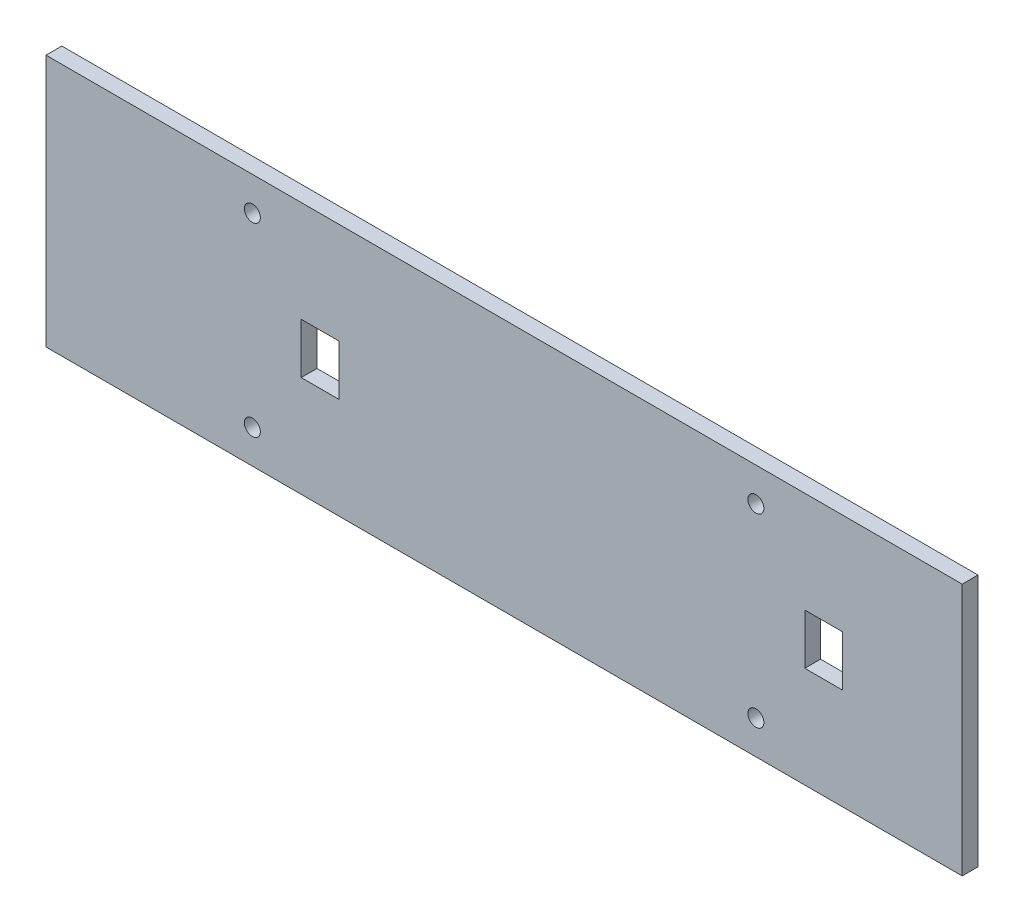
ISO-10303-21;
HEADER;
FILE_DESCRIPTION(('STEP AP214'),'2;1');
FILE_NAME('part.step','',(''),(''),'','','');
FILE_SCHEMA(('AUTOMOTIVE_DESIGN { 1 0 10303 214 1 1 1 1 }'));
ENDSEC;
DATA;
#1=APPLICATION_CONTEXT('core data for automotive mechanical design processes');
#2=APPLICATION_PROTOCOL_DEFINITION('international standard','automotive_design',2000,#1);
#3=PRODUCT_CONTEXT('',#1,'mechanical');
#4=PRODUCT('Part','Part','',(#3));
#5=PRODUCT_RELATED_PRODUCT_CATEGORY('part','',(#4));
#6=PRODUCT_DEFINITION_FORMATION('','',#4);
#7=PRODUCT_DEFINITION_CONTEXT('part definition',#1,'design');
#8=PRODUCT_DEFINITION('design','',#6,#7);
#9=PRODUCT_DEFINITION_SHAPE('','',#8);
#10=(LENGTH_UNIT() NAMED_UNIT(*) SI_UNIT(.MILLI.,.METRE.));
#11=(NAMED_UNIT(*) PLANE_ANGLE_UNIT() SI_UNIT($,.RADIAN.));
#12=(NAMED_UNIT(*) SI_UNIT($,.STERADIAN.) SOLID_ANGLE_UNIT());
#13=UNCERTAINTY_MEASURE_WITH_UNIT(LENGTH_MEASURE(1.E-05),#10,'distance_accuracy_value','');
#14=(GEOMETRIC_REPRESENTATION_CONTEXT(3) GLOBAL_UNCERTAINTY_ASSIGNED_CONTEXT((#13)) GLOBAL_UNIT_ASSIGNED_CONTEXT((#10,
#11,#12)) REPRESENTATION_CONTEXT('',''));
#15=CARTESIAN_POINT('',(0.,0.,0.));
#16=DIRECTION('',(0.,0.,1.));
#17=DIRECTION('',(1.,0.,0.));
#18=AXIS2_PLACEMENT_3D('',#15,#16,#17);
#19=CARTESIAN_POINT('',(92.075,-25.4,1.5875));
#20=DIRECTION('',(-1.,0.,0.));
#21=DIRECTION('',(0.,0.,1.));
#22=AXIS2_PLACEMENT_3D('',#19,#20,#21);
#23=PLANE('',#22);
#24=DIRECTION('',(0.,1.,0.));
#25=VECTOR('',#24,1.);
#26=CARTESIAN_POINT('',(92.075,-25.4,-1.5875));
#27=LINE('',#26,#25);
#28=CARTESIAN_POINT('',(92.075,-25.4,-1.5875));
#29=VERTEX_POINT('',#28);
#30=CARTESIAN_POINT('',(92.075,25.4,-1.5875));
#31=VERTEX_POINT('',#30);
#32=EDGE_CURVE('E195',#29,#31,#27,.T.);
#33=ORIENTED_EDGE('',*,*,#32,.T.);
#34=DIRECTION('',(0.,0.,-1.));
#35=VECTOR('',#34,1.);
#36=CARTESIAN_POINT('',(92.075,25.4,1.5875));
#37=LINE('',#36,#35);
#38=CARTESIAN_POINT('',(92.075,25.4,1.5875));
#39=VERTEX_POINT('',#38);
#40=EDGE_CURVE('E212',#39,#31,#37,.T.);
#41=ORIENTED_EDGE('',*,*,#40,.F.);
#42=DIRECTION('',(0.,1.,0.));
#43=VECTOR('',#42,1.);
#44=CARTESIAN_POINT('',(92.075,-25.4,1.5875));
#45=LINE('',#44,#43);
#46=CARTESIAN_POINT('',(92.075,-25.4,1.5875));
#47=VERTEX_POINT('',#46);
#48=EDGE_CURVE('E184',#47,#39,#45,.T.);
#49=ORIENTED_EDGE('',*,*,#48,.F.);
#50=DIRECTION('',(0.,0.,-1.));
#51=VECTOR('',#50,1.);
#52=CARTESIAN_POINT('',(92.075,-25.4,1.5875));
#53=LINE('',#52,#51);
#54=EDGE_CURVE('E194',#47,#29,#53,.T.);
#55=ORIENTED_EDGE('',*,*,#54,.T.);
#56=EDGE_LOOP('',(#33,#41,#49,#55));
#57=FACE_BOUND('',#56,.T.);
#58=ADVANCED_FACE('F35',(#57),#23,.F.);
#59=CARTESIAN_POINT('',(-92.075,25.4,1.5875));
#60=DIRECTION('',(0.,-1.,0.));
#61=DIRECTION('',(0.,0.,-1.));
#62=AXIS2_PLACEMENT_3D('',#59,#60,#61);
#63=PLANE('',#62);
#64=DIRECTION('',(-1.,0.,0.));
#65=VECTOR('',#64,1.);
#66=CARTESIAN_POINT('',(-92.075,25.4,-1.5875));
#67=LINE('',#66,#65);
#68=CARTESIAN_POINT('',(-92.075,25.4,-1.5875));
#69=VERTEX_POINT('',#68);
#70=EDGE_CURVE('E198',#31,#69,#67,.T.);
#71=ORIENTED_EDGE('',*,*,#70,.T.);
#72=DIRECTION('',(0.,0.,-1.));
#73=VECTOR('',#72,1.);
#74=CARTESIAN_POINT('',(-92.075,25.4,1.5875));
#75=LINE('',#74,#73);
#76=CARTESIAN_POINT('',(-92.075,25.4,1.5875));
#77=VERTEX_POINT('',#76);
#78=EDGE_CURVE('E209',#77,#69,#75,.T.);
#79=ORIENTED_EDGE('',*,*,#78,.F.);
#80=DIRECTION('',(-1.,0.,0.));
#81=VECTOR('',#80,1.);
#82=CARTESIAN_POINT('',(-92.075,25.4,1.5875));
#83=LINE('',#82,#81);
#84=EDGE_CURVE('E187',#39,#77,#83,.T.);
#85=ORIENTED_EDGE('',*,*,#84,.F.);
#86=ORIENTED_EDGE('',*,*,#40,.T.);
#87=EDGE_LOOP('',(#71,#79,#85,#86));
#88=FACE_BOUND('',#87,.T.);
#89=ADVANCED_FACE('F283',(#88),#63,.F.);
#90=CARTESIAN_POINT('',(-92.075,-25.4,1.5875));
#91=DIRECTION('',(1.,0.,0.));
#92=DIRECTION('',(0.,0.,-1.));
#93=AXIS2_PLACEMENT_3D('',#90,#91,#92);
#94=PLANE('',#93);
#95=DIRECTION('',(0.,-1.,0.));
#96=VECTOR('',#95,1.);
#97=CARTESIAN_POINT('',(-92.075,-25.4,-1.5875));
#98=LINE('',#97,#96);
#99=CARTESIAN_POINT('',(-92.075,-25.4,-1.5875));
#100=VERTEX_POINT('',#99);
#101=EDGE_CURVE('E201',#69,#100,#98,.T.);
#102=ORIENTED_EDGE('',*,*,#101,.T.);
#103=DIRECTION('',(0.,0.,-1.));
#104=VECTOR('',#103,1.);
#105=CARTESIAN_POINT('',(-92.075,-25.4,1.5875));
#106=LINE('',#105,#104);
#107=CARTESIAN_POINT('',(-92.075,-25.4,1.5875));
#108=VERTEX_POINT('',#107);
#109=EDGE_CURVE('E206',#108,#100,#106,.T.);
#110=ORIENTED_EDGE('',*,*,#109,.F.);
#111=DIRECTION('',(0.,-1.,0.));
#112=VECTOR('',#111,1.);
#113=CARTESIAN_POINT('',(-92.075,-25.4,1.5875));
#114=LINE('',#113,#112);
#115=EDGE_CURVE('E190',#77,#108,#114,.T.);
#116=ORIENTED_EDGE('',*,*,#115,.F.);
#117=ORIENTED_EDGE('',*,*,#78,.T.);
#118=EDGE_LOOP('',(#102,#110,#116,#117));
#119=FACE_BOUND('',#118,.T.);
#120=ADVANCED_FACE('F288',(#119),#94,.F.);
#121=CARTESIAN_POINT('',(-92.075,-25.4,1.5875));
#122=DIRECTION('',(0.,1.,0.));
#123=DIRECTION('',(0.,0.,1.));
#124=AXIS2_PLACEMENT_3D('',#121,#122,#123);
#125=PLANE('',#124);
#126=DIRECTION('',(1.,0.,0.));
#127=VECTOR('',#126,1.);
#128=CARTESIAN_POINT('',(-92.075,-25.4,-1.5875));
#129=LINE('',#128,#127);
#130=EDGE_CURVE('E188',#100,#29,#129,.T.);
#131=ORIENTED_EDGE('',*,*,#130,.T.);
#132=ORIENTED_EDGE('',*,*,#54,.F.);
#133=DIRECTION('',(1.,0.,0.));
#134=VECTOR('',#133,1.);
#135=CARTESIAN_POINT('',(-92.075,-25.4,1.5875));
#136=LINE('',#135,#134);
#137=EDGE_CURVE('E192',#108,#47,#136,.T.);
#138=ORIENTED_EDGE('',*,*,#137,.F.);
#139=ORIENTED_EDGE('',*,*,#109,.T.);
#140=EDGE_LOOP('',(#131,#132,#138,#139));
#141=FACE_BOUND('',#140,.T.);
#142=ADVANCED_FACE('F258',(#141),#125,.F.);
#143=CARTESIAN_POINT('',(0.,0.,1.5875));
#144=DIRECTION('',(0.,0.,-1.));
#145=DIRECTION('',(-1.,0.,0.));
#146=AXIS2_PLACEMENT_3D('',#143,#144,#145);
#147=PLANE('',#146);
#148=DIRECTION('',(0.,-1.,0.));
#149=VECTOR('',#148,1.);
#150=CARTESIAN_POINT('',(60.43,5.07500000000018,1.5875));
#151=LINE('',#150,#149);
#152=CARTESIAN_POINT('',(60.43,5.07500000000018,1.5875));
#153=VERTEX_POINT('',#152);
#154=CARTESIAN_POINT('',(60.43,-5.07499999999982,1.5875));
#155=VERTEX_POINT('',#154);
#156=EDGE_CURVE('E164',#153,#155,#151,.T.);
#157=ORIENTED_EDGE('',*,*,#156,.F.);
#158=DIRECTION('',(-1.,0.,0.));
#159=VECTOR('',#158,1.);
#160=CARTESIAN_POINT('',(60.43,5.07500000000018,1.5875));
#161=LINE('',#160,#159);
#162=CARTESIAN_POINT('',(68.05,5.07500000000018,1.5875));
#163=VERTEX_POINT('',#162);
#164=EDGE_CURVE('E49',#163,#153,#161,.T.);
#165=ORIENTED_EDGE('',*,*,#164,.F.);
#166=DIRECTION('',(0.,1.,0.));
#167=VECTOR('',#166,1.);
#168=CARTESIAN_POINT('',(68.05,5.07500000000018,1.5875));
#169=LINE('',#168,#167);
#170=CARTESIAN_POINT('',(68.05,-5.07499999999981,1.5875));
#171=VERTEX_POINT('',#170);
#172=EDGE_CURVE('E170',#171,#163,#169,.T.);
#173=ORIENTED_EDGE('',*,*,#172,.F.);
#174=DIRECTION('',(1.,0.,0.));
#175=VECTOR('',#174,1.);
#176=CARTESIAN_POINT('',(60.43,-5.07499999999982,1.5875));
#177=LINE('',#176,#175);
#178=EDGE_CURVE('E167',#155,#171,#177,.T.);
#179=ORIENTED_EDGE('',*,*,#178,.F.);
#180=EDGE_LOOP('',(#157,#165,#173,#179));
#181=FACE_BOUND('',#180,.T.);
#182=CARTESIAN_POINT('',(-50.6050000089999,-18.6399999999998,1.5875));
#183=DIRECTION('',(0.,0.,1.));
#184=DIRECTION('',(1.,0.,0.));
#185=AXIS2_PLACEMENT_3D('',#182,#183,#184);
#186=CIRCLE('',#185,1.61000000000001);
#187=CARTESIAN_POINT('',(-48.9950000089998,-18.6399999999998,1.5875));
#188=VERTEX_POINT('',#187);
#189=EDGE_CURVE('E156',#188,#188,#186,.T.);
#190=ORIENTED_EDGE('',*,*,#189,.F.);
#191=EDGE_LOOP('',(#190));
#192=FACE_BOUND('',#191,.T.);
#193=CARTESIAN_POINT('',(50.605000009,18.6400000000002,1.5875));
#194=DIRECTION('',(0.,0.,1.));
#195=DIRECTION('',(1.,0.,0.));
#196=AXIS2_PLACEMENT_3D('',#193,#194,#195);
#197=CIRCLE('',#196,1.61);
#198=CARTESIAN_POINT('',(52.215000009,18.6400000000002,1.5875));
#199=VERTEX_POINT('',#198);
#200=EDGE_CURVE('E160',#199,#199,#197,.T.);
#201=ORIENTED_EDGE('',*,*,#200,.F.);
#202=EDGE_LOOP('',(#201));
#203=FACE_BOUND('',#202,.T.);
#204=CARTESIAN_POINT('',(50.605000009,-18.6399999999998,1.5875));
#205=DIRECTION('',(0.,0.,1.));
#206=DIRECTION('',(1.,0.,0.));
#207=AXIS2_PLACEMENT_3D('',#204,#205,#206);
#208=CIRCLE('',#207,1.61);
#209=CARTESIAN_POINT('',(52.215000009,-18.6399999999998,1.5875));
#210=VERTEX_POINT('',#209);
#211=EDGE_CURVE('E153',#210,#210,#208,.T.);
#212=ORIENTED_EDGE('',*,*,#211,.F.);
#213=EDGE_LOOP('',(#212));
#214=FACE_BOUND('',#213,.T.);
#215=DIRECTION('',(0.,-1.,0.));
#216=VECTOR('',#215,1.);
#217=CARTESIAN_POINT('',(-40.7800000179999,5.07500000000017,1.5875));
#218=LINE('',#217,#216);
#219=CARTESIAN_POINT('',(-40.7800000179999,5.07500000000017,1.5875));
#220=VERTEX_POINT('',#219);
#221=CARTESIAN_POINT('',(-40.7800000179999,-5.07499999999983,1.5875));
#222=VERTEX_POINT('',#221);
#223=EDGE_CURVE('E139',#220,#222,#218,.T.);
#224=ORIENTED_EDGE('',*,*,#223,.F.);
#225=DIRECTION('',(-1.,0.,0.));
#226=VECTOR('',#225,1.);
#227=CARTESIAN_POINT('',(-40.7800000179999,5.07500000000017,1.5875));
#228=LINE('',#227,#226);
#229=CARTESIAN_POINT('',(-33.1600000179999,5.07500000000017,1.5875));
#230=VERTEX_POINT('',#229);
#231=EDGE_CURVE('E57',#230,#220,#228,.T.);
#232=ORIENTED_EDGE('',*,*,#231,.F.);
#233=DIRECTION('',(0.,1.,0.));
#234=VECTOR('',#233,1.);
#235=CARTESIAN_POINT('',(-33.1600000179999,5.07500000000017,1.5875));
#236=LINE('',#235,#234);
#237=CARTESIAN_POINT('',(-33.1600000179999,-5.07499999999983,1.5875));
#238=VERTEX_POINT('',#237);
#239=EDGE_CURVE('E146',#238,#230,#236,.T.);
#240=ORIENTED_EDGE('',*,*,#239,.F.);
#241=DIRECTION('',(1.,0.,0.));
#242=VECTOR('',#241,1.);
#243=CARTESIAN_POINT('',(-40.7800000179999,-5.07499999999983,1.5875));
#244=LINE('',#243,#242);
#245=EDGE_CURVE('E129',#222,#238,#244,.T.);
#246=ORIENTED_EDGE('',*,*,#245,.F.);
#247=EDGE_LOOP('',(#224,#232,#240,#246));
#248=FACE_BOUND('',#247,.T.);
#249=CARTESIAN_POINT('',(-50.6050000089999,18.6400000000001,1.5875));
#250=DIRECTION('',(0.,0.,1.));
#251=DIRECTION('',(1.,0.,0.));
#252=AXIS2_PLACEMENT_3D('',#249,#250,#251);
#253=CIRCLE('',#252,1.61);
#254=CARTESIAN_POINT('',(-48.9950000089999,18.6400000000001,1.5875));
#255=VERTEX_POINT('',#254);
#256=EDGE_CURVE('E159',#255,#255,#253,.T.);
#257=ORIENTED_EDGE('',*,*,#256,.F.);
#258=EDGE_LOOP('',(#257));
#259=FACE_BOUND('',#258,.T.);
#260=ORIENTED_EDGE('',*,*,#48,.T.);
#261=ORIENTED_EDGE('',*,*,#84,.T.);
#262=ORIENTED_EDGE('',*,*,#115,.T.);
#263=ORIENTED_EDGE('',*,*,#137,.T.);
#264=EDGE_LOOP('',(#260,#261,#262,#263));
#265=FACE_BOUND('',#264,.T.);
#266=ADVANCED_FACE('F143',(#181,#192,#203,#214,#248,#259,#265),#147,.F.);
#267=CARTESIAN_POINT('',(0.,0.,-1.5875));
#268=DIRECTION('',(0.,0.,-1.));
#269=DIRECTION('',(-1.,0.,0.));
#270=AXIS2_PLACEMENT_3D('',#267,#268,#269);
#271=PLANE('',#270);
#272=DIRECTION('',(1.,0.,0.));
#273=VECTOR('',#272,1.);
#274=CARTESIAN_POINT('',(0.,5.07500000000016,-1.5875));
#275=LINE('',#274,#273);
#276=CARTESIAN_POINT('',(60.43,5.07500000000018,-1.5875));
#277=VERTEX_POINT('',#276);
#278=CARTESIAN_POINT('',(68.05,5.07500000000018,-1.5875));
#279=VERTEX_POINT('',#278);
#280=EDGE_CURVE('E11',#277,#279,#275,.T.);
#281=ORIENTED_EDGE('',*,*,#280,.F.);
#282=DIRECTION('',(0.,1.,0.));
#283=VECTOR('',#282,1.);
#284=CARTESIAN_POINT('',(60.43,0.,-1.5875));
#285=LINE('',#284,#283);
#286=CARTESIAN_POINT('',(60.43,-5.07499999999982,-1.5875));
#287=VERTEX_POINT('',#286);
#288=EDGE_CURVE('E225',#287,#277,#285,.T.);
#289=ORIENTED_EDGE('',*,*,#288,.F.);
#290=DIRECTION('',(-1.,0.,0.));
#291=VECTOR('',#290,1.);
#292=CARTESIAN_POINT('',(0.,-5.07499999999985,-1.5875));
#293=LINE('',#292,#291);
#294=CARTESIAN_POINT('',(68.05,-5.07499999999981,-1.5875));
#295=VERTEX_POINT('',#294);
#296=EDGE_CURVE('E234',#295,#287,#293,.T.);
#297=ORIENTED_EDGE('',*,*,#296,.F.);
#298=DIRECTION('',(0.,-1.,0.));
#299=VECTOR('',#298,1.);
#300=CARTESIAN_POINT('',(68.05,0.,-1.5875));
#301=LINE('',#300,#299);
#302=EDGE_CURVE('E42',#279,#295,#301,.T.);
#303=ORIENTED_EDGE('',*,*,#302,.F.);
#304=EDGE_LOOP('',(#281,#289,#297,#303));
#305=FACE_BOUND('',#304,.T.);
#306=CARTESIAN_POINT('',(-50.6050000089999,-18.6399999999998,-1.5875));
#307=DIRECTION('',(0.,0.,-1.));
#308=DIRECTION('',(-1.,0.,0.));
#309=AXIS2_PLACEMENT_3D('',#306,#307,#308);
#310=CIRCLE('',#309,1.61000000000001);
#311=CARTESIAN_POINT('',(-52.2150000089999,-18.6399999999998,-1.5875));
#312=VERTEX_POINT('',#311);
#313=EDGE_CURVE('E199',#312,#312,#310,.T.);
#314=ORIENTED_EDGE('',*,*,#313,.F.);
#315=EDGE_LOOP('',(#314));
#316=FACE_BOUND('',#315,.T.);
#317=CARTESIAN_POINT('',(50.605000009,18.6400000000002,-1.5875));
#318=DIRECTION('',(0.,0.,-1.));
#319=DIRECTION('',(-1.,0.,0.));
#320=AXIS2_PLACEMENT_3D('',#317,#318,#319);
#321=CIRCLE('',#320,1.61);
#322=CARTESIAN_POINT('',(48.995000009,18.6400000000002,-1.5875));
#323=VERTEX_POINT('',#322);
#324=EDGE_CURVE('E228',#323,#323,#321,.T.);
#325=ORIENTED_EDGE('',*,*,#324,.F.);
#326=EDGE_LOOP('',(#325));
#327=FACE_BOUND('',#326,.T.);
#328=CARTESIAN_POINT('',(50.605000009,-18.6399999999998,-1.5875));
#329=DIRECTION('',(0.,0.,-1.));
#330=DIRECTION('',(-1.,0.,0.));
#331=AXIS2_PLACEMENT_3D('',#328,#329,#330);
#332=CIRCLE('',#331,1.61);
#333=CARTESIAN_POINT('',(48.995000009,-18.6399999999998,-1.5875));
#334=VERTEX_POINT('',#333);
#335=EDGE_CURVE('E218',#334,#334,#332,.T.);
#336=ORIENTED_EDGE('',*,*,#335,.F.);
#337=EDGE_LOOP('',(#336));
#338=FACE_BOUND('',#337,.T.);
#339=DIRECTION('',(1.,0.,0.));
#340=VECTOR('',#339,1.);
#341=CARTESIAN_POINT('',(0.,5.07500000000018,-1.5875));
#342=LINE('',#341,#340);
#343=CARTESIAN_POINT('',(-40.7800000179999,5.07500000000017,-1.5875));
#344=VERTEX_POINT('',#343);
#345=CARTESIAN_POINT('',(-33.1600000179999,5.07500000000017,-1.5875));
#346=VERTEX_POINT('',#345);
#347=EDGE_CURVE('E223',#344,#346,#342,.T.);
#348=ORIENTED_EDGE('',*,*,#347,.F.);
#349=DIRECTION('',(0.,1.,0.));
#350=VECTOR('',#349,1.);
#351=CARTESIAN_POINT('',(-40.7800000179999,0.,-1.5875));
#352=LINE('',#351,#350);
#353=CARTESIAN_POINT('',(-40.7800000179999,-5.07499999999983,-1.5875));
#354=VERTEX_POINT('',#353);
#355=EDGE_CURVE('E215',#354,#344,#352,.T.);
#356=ORIENTED_EDGE('',*,*,#355,.F.);
#357=DIRECTION('',(-1.,0.,0.));
#358=VECTOR('',#357,1.);
#359=CARTESIAN_POINT('',(0.,-5.07499999999982,-1.5875));
#360=LINE('',#359,#358);
#361=CARTESIAN_POINT('',(-33.1600000179999,-5.07499999999983,-1.5875));
#362=VERTEX_POINT('',#361);
#363=EDGE_CURVE('E132',#362,#354,#360,.T.);
#364=ORIENTED_EDGE('',*,*,#363,.F.);
#365=DIRECTION('',(0.,-1.,0.));
#366=VECTOR('',#365,1.);
#367=CARTESIAN_POINT('',(-33.1600000179999,0.,-1.5875));
#368=LINE('',#367,#366);
#369=EDGE_CURVE('E221',#346,#362,#368,.T.);
#370=ORIENTED_EDGE('',*,*,#369,.F.);
#371=EDGE_LOOP('',(#348,#356,#364,#370));
#372=FACE_BOUND('',#371,.T.);
#373=CARTESIAN_POINT('',(-50.6050000089999,18.6400000000001,-1.5875));
#374=DIRECTION('',(0.,0.,-1.));
#375=DIRECTION('',(-1.,0.,0.));
#376=AXIS2_PLACEMENT_3D('',#373,#374,#375);
#377=CIRCLE('',#376,1.61);
#378=CARTESIAN_POINT('',(-52.2150000089999,18.6400000000001,-1.5875));
#379=VERTEX_POINT('',#378);
#380=EDGE_CURVE('E183',#379,#379,#377,.T.);
#381=ORIENTED_EDGE('',*,*,#380,.F.);
#382=EDGE_LOOP('',(#381));
#383=FACE_BOUND('',#382,.T.);
#384=ORIENTED_EDGE('',*,*,#32,.F.);
#385=ORIENTED_EDGE('',*,*,#130,.F.);
#386=ORIENTED_EDGE('',*,*,#101,.F.);
#387=ORIENTED_EDGE('',*,*,#70,.F.);
#388=EDGE_LOOP('',(#384,#385,#386,#387));
#389=FACE_BOUND('',#388,.T.);
#390=ADVANCED_FACE('F249',(#305,#316,#327,#338,#372,#383,#389),#271,.T.);
#391=CARTESIAN_POINT('',(-50.6050000089999,18.6400000000001,-3.4925));
#392=DIRECTION('',(0.,0.,1.));
#393=DIRECTION('',(1.,0.,0.));
#394=AXIS2_PLACEMENT_3D('',#391,#392,#393);
#395=CYLINDRICAL_SURFACE('',#394,1.61);
#396=ORIENTED_EDGE('',*,*,#380,.T.);
#397=EDGE_LOOP('',(#396));
#398=FACE_BOUND('',#397,.T.);
#399=ORIENTED_EDGE('',*,*,#256,.T.);
#400=EDGE_LOOP('',(#399));
#401=FACE_BOUND('',#400,.T.);
#402=ADVANCED_FACE('F312',(#398,#401),#395,.F.);
#403=CARTESIAN_POINT('',(-40.7800000179999,5.07500000000017,-3.4925));
#404=DIRECTION('',(0.,1.,0.));
#405=DIRECTION('',(-1.,0.,0.));
#406=AXIS2_PLACEMENT_3D('',#403,#404,#405);
#407=PLANE('',#406);
#408=ORIENTED_EDGE('',*,*,#347,.T.);
#409=DIRECTION('',(0.,0.,1.));
#410=VECTOR('',#409,1.);
#411=CARTESIAN_POINT('',(-33.1600000179999,5.07500000000017,-3.4925));
#412=LINE('',#411,#410);
#413=EDGE_CURVE('E151',#346,#230,#412,.T.);
#414=ORIENTED_EDGE('',*,*,#413,.T.);
#415=ORIENTED_EDGE('',*,*,#231,.T.);
#416=DIRECTION('',(0.,0.,1.));
#417=VECTOR('',#416,1.);
#418=CARTESIAN_POINT('',(-40.7800000179999,5.07500000000017,-3.4925));
#419=LINE('',#418,#417);
#420=EDGE_CURVE('E136',#344,#220,#419,.T.);
#421=ORIENTED_EDGE('',*,*,#420,.F.);
#422=EDGE_LOOP('',(#408,#414,#415,#421));
#423=FACE_BOUND('',#422,.T.);
#424=ADVANCED_FACE('F316',(#423),#407,.F.);
#425=CARTESIAN_POINT('',(-33.1600000179999,5.07500000000017,-3.4925));
#426=DIRECTION('',(1.,0.,0.));
#427=DIRECTION('',(0.,0.,-1.));
#428=AXIS2_PLACEMENT_3D('',#425,#426,#427);
#429=PLANE('',#428);
#430=ORIENTED_EDGE('',*,*,#369,.T.);
#431=DIRECTION('',(0.,0.,1.));
#432=VECTOR('',#431,1.);
#433=CARTESIAN_POINT('',(-33.1600000179999,-5.07499999999983,-3.4925));
#434=LINE('',#433,#432);
#435=EDGE_CURVE('E135',#362,#238,#434,.T.);
#436=ORIENTED_EDGE('',*,*,#435,.T.);
#437=ORIENTED_EDGE('',*,*,#239,.T.);
#438=ORIENTED_EDGE('',*,*,#413,.F.);
#439=EDGE_LOOP('',(#430,#436,#437,#438));
#440=FACE_BOUND('',#439,.T.);
#441=ADVANCED_FACE('F330',(#440),#429,.F.);
#442=CARTESIAN_POINT('',(-40.7800000179999,-5.07499999999983,-3.4925));
#443=DIRECTION('',(0.,-1.,0.));
#444=DIRECTION('',(1.,0.,0.));
#445=AXIS2_PLACEMENT_3D('',#442,#443,#444);
#446=PLANE('',#445);
#447=ORIENTED_EDGE('',*,*,#363,.T.);
#448=DIRECTION('',(0.,0.,1.));
#449=VECTOR('',#448,1.);
#450=CARTESIAN_POINT('',(-40.7800000179999,-5.07499999999983,-3.4925));
#451=LINE('',#450,#449);
#452=EDGE_CURVE('E124',#354,#222,#451,.T.);
#453=ORIENTED_EDGE('',*,*,#452,.T.);
#454=ORIENTED_EDGE('',*,*,#245,.T.);
#455=ORIENTED_EDGE('',*,*,#435,.F.);
#456=EDGE_LOOP('',(#447,#453,#454,#455));
#457=FACE_BOUND('',#456,.T.);
#458=ADVANCED_FACE('F126',(#457),#446,.F.);
#459=CARTESIAN_POINT('',(-40.7800000179999,5.07500000000017,-3.4925));
#460=DIRECTION('',(-1.,0.,0.));
#461=DIRECTION('',(0.,-1.,0.));
#462=AXIS2_PLACEMENT_3D('',#459,#460,#461);
#463=PLANE('',#462);
#464=ORIENTED_EDGE('',*,*,#355,.T.);
#465=ORIENTED_EDGE('',*,*,#420,.T.);
#466=ORIENTED_EDGE('',*,*,#223,.T.);
#467=ORIENTED_EDGE('',*,*,#452,.F.);
#468=EDGE_LOOP('',(#464,#465,#466,#467));
#469=FACE_BOUND('',#468,.T.);
#470=ADVANCED_FACE('F140',(#469),#463,.F.);
#471=CARTESIAN_POINT('',(50.605000009,-18.6399999999998,-3.4925));
#472=DIRECTION('',(0.,0.,1.));
#473=DIRECTION('',(1.,0.,0.));
#474=AXIS2_PLACEMENT_3D('',#471,#472,#473);
#475=CYLINDRICAL_SURFACE('',#474,1.61);
#476=ORIENTED_EDGE('',*,*,#335,.T.);
#477=EDGE_LOOP('',(#476));
#478=FACE_BOUND('',#477,.T.);
#479=ORIENTED_EDGE('',*,*,#211,.T.);
#480=EDGE_LOOP('',(#479));
#481=FACE_BOUND('',#480,.T.);
#482=ADVANCED_FACE('F268',(#478,#481),#475,.F.);
#483=CARTESIAN_POINT('',(50.605000009,18.6400000000002,-3.4925));
#484=DIRECTION('',(0.,0.,1.));
#485=DIRECTION('',(1.,0.,0.));
#486=AXIS2_PLACEMENT_3D('',#483,#484,#485);
#487=CYLINDRICAL_SURFACE('',#486,1.61);
#488=ORIENTED_EDGE('',*,*,#324,.T.);
#489=EDGE_LOOP('',(#488));
#490=FACE_BOUND('',#489,.T.);
#491=ORIENTED_EDGE('',*,*,#200,.T.);
#492=EDGE_LOOP('',(#491));
#493=FACE_BOUND('',#492,.T.);
#494=ADVANCED_FACE('F270',(#490,#493),#487,.F.);
#495=CARTESIAN_POINT('',(-50.6050000089999,-18.6399999999998,-3.4925));
#496=DIRECTION('',(0.,0.,1.));
#497=DIRECTION('',(1.,0.,0.));
#498=AXIS2_PLACEMENT_3D('',#495,#496,#497);
#499=CYLINDRICAL_SURFACE('',#498,1.61000000000001);
#500=ORIENTED_EDGE('',*,*,#313,.T.);
#501=EDGE_LOOP('',(#500));
#502=FACE_BOUND('',#501,.T.);
#503=ORIENTED_EDGE('',*,*,#189,.T.);
#504=EDGE_LOOP('',(#503));
#505=FACE_BOUND('',#504,.T.);
#506=ADVANCED_FACE('F277',(#502,#505),#499,.F.);
#507=CARTESIAN_POINT('',(60.43,5.07500000000018,-3.4925));
#508=DIRECTION('',(0.,1.,0.));
#509=DIRECTION('',(-1.,0.,0.));
#510=AXIS2_PLACEMENT_3D('',#507,#508,#509);
#511=PLANE('',#510);
#512=ORIENTED_EDGE('',*,*,#280,.T.);
#513=DIRECTION('',(0.,0.,1.));
#514=VECTOR('',#513,1.);
#515=CARTESIAN_POINT('',(68.05,5.07500000000018,-3.4925));
#516=LINE('',#515,#514);
#517=EDGE_CURVE('E174',#279,#163,#516,.T.);
#518=ORIENTED_EDGE('',*,*,#517,.T.);
#519=ORIENTED_EDGE('',*,*,#164,.T.);
#520=DIRECTION('',(0.,0.,1.));
#521=VECTOR('',#520,1.);
#522=CARTESIAN_POINT('',(60.43,5.07500000000018,-3.4925));
#523=LINE('',#522,#521);
#524=EDGE_CURVE('E173',#277,#153,#523,.T.);
#525=ORIENTED_EDGE('',*,*,#524,.F.);
#526=EDGE_LOOP('',(#512,#518,#519,#525));
#527=FACE_BOUND('',#526,.T.);
#528=ADVANCED_FACE('F254',(#527),#511,.F.);
#529=CARTESIAN_POINT('',(68.05,5.07500000000018,-3.4925));
#530=DIRECTION('',(1.,0.,0.));
#531=DIRECTION('',(0.,0.,-1.));
#532=AXIS2_PLACEMENT_3D('',#529,#530,#531);
#533=PLANE('',#532);
#534=ORIENTED_EDGE('',*,*,#302,.T.);
#535=DIRECTION('',(0.,0.,1.));
#536=VECTOR('',#535,1.);
#537=CARTESIAN_POINT('',(68.05,-5.07499999999981,-3.4925));
#538=LINE('',#537,#536);
#539=EDGE_CURVE('E176',#295,#171,#538,.T.);
#540=ORIENTED_EDGE('',*,*,#539,.T.);
#541=ORIENTED_EDGE('',*,*,#172,.T.);
#542=ORIENTED_EDGE('',*,*,#517,.F.);
#543=EDGE_LOOP('',(#534,#540,#541,#542));
#544=FACE_BOUND('',#543,.T.);
#545=ADVANCED_FACE('F240',(#544),#533,.F.);
#546=CARTESIAN_POINT('',(60.43,-5.07499999999982,-3.4925));
#547=DIRECTION('',(0.,-1.,0.));
#548=DIRECTION('',(1.,0.,0.));
#549=AXIS2_PLACEMENT_3D('',#546,#547,#548);
#550=PLANE('',#549);
#551=ORIENTED_EDGE('',*,*,#296,.T.);
#552=DIRECTION('',(0.,0.,1.));
#553=VECTOR('',#552,1.);
#554=CARTESIAN_POINT('',(60.43,-5.07499999999982,-3.4925));
#555=LINE('',#554,#553);
#556=EDGE_CURVE('E178',#287,#155,#555,.T.);
#557=ORIENTED_EDGE('',*,*,#556,.T.);
#558=ORIENTED_EDGE('',*,*,#178,.T.);
#559=ORIENTED_EDGE('',*,*,#539,.F.);
#560=EDGE_LOOP('',(#551,#557,#558,#559));
#561=FACE_BOUND('',#560,.T.);
#562=ADVANCED_FACE('F245',(#561),#550,.F.);
#563=CARTESIAN_POINT('',(60.43,5.07500000000018,-3.4925));
#564=DIRECTION('',(-1.,0.,0.));
#565=DIRECTION('',(0.,-1.,0.));
#566=AXIS2_PLACEMENT_3D('',#563,#564,#565);
#567=PLANE('',#566);
#568=ORIENTED_EDGE('',*,*,#288,.T.);
#569=ORIENTED_EDGE('',*,*,#524,.T.);
#570=ORIENTED_EDGE('',*,*,#156,.T.);
#571=ORIENTED_EDGE('',*,*,#556,.F.);
#572=EDGE_LOOP('',(#568,#569,#570,#571));
#573=FACE_BOUND('',#572,.T.);
#574=ADVANCED_FACE('F252',(#573),#567,.F.);
#575=CLOSED_SHELL('',(#58,#89,#120,#142,#266,#390,#402,#424,#441,#458,#470,#482,#494,#506,#528,
#545,#562,#574));
#576=MANIFOLD_SOLID_BREP('B2',#575);
#577=ADVANCED_BREP_SHAPE_REPRESENTATION('',(#18,#576),#14);
#578=SHAPE_DEFINITION_REPRESENTATION(#9,#577);
ENDSEC;
END-ISO-10303-21;
